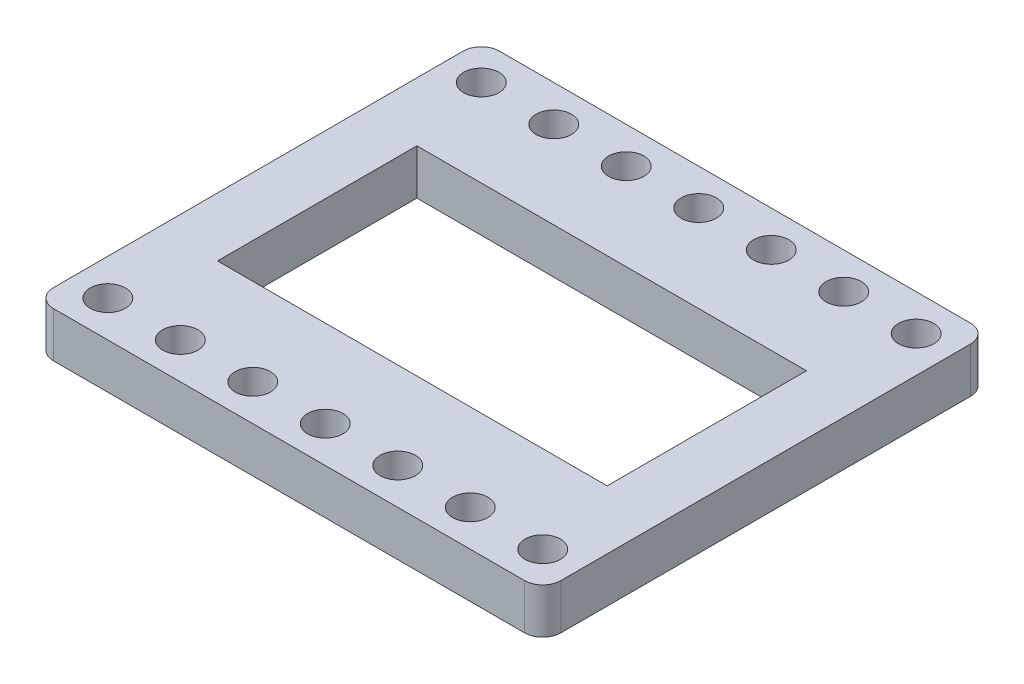
ISO-10303-21;
HEADER;
FILE_DESCRIPTION(('STEP AP214'),'2;1');
FILE_NAME('part.step','',(''),(''),'','','');
FILE_SCHEMA(('AUTOMOTIVE_DESIGN { 1 0 10303 214 1 1 1 1 }'));
ENDSEC;
DATA;
#1=APPLICATION_CONTEXT('core data for automotive mechanical design processes');
#2=APPLICATION_PROTOCOL_DEFINITION('international standard','automotive_design',2000,#1);
#3=PRODUCT_CONTEXT('',#1,'mechanical');
#4=PRODUCT('Part','Part','',(#3));
#5=PRODUCT_RELATED_PRODUCT_CATEGORY('part','',(#4));
#6=PRODUCT_DEFINITION_FORMATION('','',#4);
#7=PRODUCT_DEFINITION_CONTEXT('part definition',#1,'design');
#8=PRODUCT_DEFINITION('design','',#6,#7);
#9=PRODUCT_DEFINITION_SHAPE('','',#8);
#10=(LENGTH_UNIT() NAMED_UNIT(*) SI_UNIT(.MILLI.,.METRE.));
#11=(NAMED_UNIT(*) PLANE_ANGLE_UNIT() SI_UNIT($,.RADIAN.));
#12=(NAMED_UNIT(*) SI_UNIT($,.STERADIAN.) SOLID_ANGLE_UNIT());
#13=UNCERTAINTY_MEASURE_WITH_UNIT(LENGTH_MEASURE(1.E-05),#10,'distance_accuracy_value','');
#14=(GEOMETRIC_REPRESENTATION_CONTEXT(3) GLOBAL_UNCERTAINTY_ASSIGNED_CONTEXT((#13)) GLOBAL_UNIT_ASSIGNED_CONTEXT((#10,
#11,#12)) REPRESENTATION_CONTEXT('',''));
#15=CARTESIAN_POINT('',(0.,0.,0.));
#16=DIRECTION('',(0.,0.,1.));
#17=DIRECTION('',(1.,0.,0.));
#18=AXIS2_PLACEMENT_3D('',#15,#16,#17);
#19=CARTESIAN_POINT('',(-1.99999999999999,5.,47.22));
#20=DIRECTION('',(0.,-1.,0.));
#21=DIRECTION('',(0.,0.,-1.));
#22=AXIS2_PLACEMENT_3D('',#19,#20,#21);
#23=CYLINDRICAL_SURFACE('',#22,2.);
#24=CARTESIAN_POINT('',(-1.99999999999999,0.,47.22));
#25=DIRECTION('',(0.,1.,0.));
#26=DIRECTION('',(0.,0.,1.));
#27=AXIS2_PLACEMENT_3D('',#24,#25,#26);
#28=CIRCLE('',#27,2.);
#29=CARTESIAN_POINT('',(-1.99999999999999,0.,49.22));
#30=VERTEX_POINT('',#29);
#31=CARTESIAN_POINT('',(0.,0.,47.22));
#32=VERTEX_POINT('',#31);
#33=EDGE_CURVE('E236',#30,#32,#28,.T.);
#34=ORIENTED_EDGE('',*,*,#33,.T.);
#35=DIRECTION('',(0.,-1.,0.));
#36=VECTOR('',#35,1.);
#37=CARTESIAN_POINT('',(0.,5.,47.22));
#38=LINE('',#37,#36);
#39=CARTESIAN_POINT('',(0.,5.,47.22));
#40=VERTEX_POINT('',#39);
#41=EDGE_CURVE('E11',#40,#32,#38,.T.);
#42=ORIENTED_EDGE('',*,*,#41,.F.);
#43=CARTESIAN_POINT('',(-1.99999999999999,5.,47.22));
#44=DIRECTION('',(0.,1.,0.));
#45=DIRECTION('',(0.,0.,1.));
#46=AXIS2_PLACEMENT_3D('',#43,#44,#45);
#47=CIRCLE('',#46,2.);
#48=CARTESIAN_POINT('',(-1.99999999999999,5.,49.22));
#49=VERTEX_POINT('',#48);
#50=EDGE_CURVE('E239',#49,#40,#47,.T.);
#51=ORIENTED_EDGE('',*,*,#50,.F.);
#52=DIRECTION('',(0.,-1.,0.));
#53=VECTOR('',#52,1.);
#54=CARTESIAN_POINT('',(-1.99999999999999,5.,49.22));
#55=LINE('',#54,#53);
#56=EDGE_CURVE('E257',#49,#30,#55,.T.);
#57=ORIENTED_EDGE('',*,*,#56,.T.);
#58=EDGE_LOOP('',(#34,#42,#51,#57));
#59=FACE_BOUND('',#58,.T.);
#60=ADVANCED_FACE('F32',(#59),#23,.T.);
#61=CARTESIAN_POINT('',(0.,5.,2.));
#62=DIRECTION('',(-1.,0.,0.));
#63=DIRECTION('',(0.,0.,1.));
#64=AXIS2_PLACEMENT_3D('',#61,#62,#63);
#65=PLANE('',#64);
#66=DIRECTION('',(0.,0.,-1.));
#67=VECTOR('',#66,1.);
#68=CARTESIAN_POINT('',(0.,0.,2.));
#69=LINE('',#68,#67);
#70=CARTESIAN_POINT('',(0.,0.,2.));
#71=VERTEX_POINT('',#70);
#72=EDGE_CURVE('E260',#32,#71,#69,.T.);
#73=ORIENTED_EDGE('',*,*,#72,.T.);
#74=DIRECTION('',(0.,-1.,0.));
#75=VECTOR('',#74,1.);
#76=CARTESIAN_POINT('',(0.,5.,2.));
#77=LINE('',#76,#75);
#78=CARTESIAN_POINT('',(0.,5.,2.));
#79=VERTEX_POINT('',#78);
#80=EDGE_CURVE('E39',#79,#71,#77,.T.);
#81=ORIENTED_EDGE('',*,*,#80,.F.);
#82=DIRECTION('',(0.,0.,-1.));
#83=VECTOR('',#82,1.);
#84=CARTESIAN_POINT('',(0.,5.,2.));
#85=LINE('',#84,#83);
#86=EDGE_CURVE('E242',#40,#79,#85,.T.);
#87=ORIENTED_EDGE('',*,*,#86,.F.);
#88=ORIENTED_EDGE('',*,*,#41,.T.);
#89=EDGE_LOOP('',(#73,#81,#87,#88));
#90=FACE_BOUND('',#89,.T.);
#91=ADVANCED_FACE('F316',(#90),#65,.F.);
#92=CARTESIAN_POINT('',(-2.,5.,2.));
#93=DIRECTION('',(0.,-1.,0.));
#94=DIRECTION('',(0.,0.,-1.));
#95=AXIS2_PLACEMENT_3D('',#92,#93,#94);
#96=CYLINDRICAL_SURFACE('',#95,2.);
#97=CARTESIAN_POINT('',(-2.,0.,2.));
#98=DIRECTION('',(0.,1.,0.));
#99=DIRECTION('',(0.,0.,-1.));
#100=AXIS2_PLACEMENT_3D('',#97,#98,#99);
#101=CIRCLE('',#100,2.);
#102=CARTESIAN_POINT('',(-2.,0.,0.));
#103=VERTEX_POINT('',#102);
#104=EDGE_CURVE('E262',#71,#103,#101,.T.);
#105=ORIENTED_EDGE('',*,*,#104,.T.);
#106=DIRECTION('',(0.,-1.,0.));
#107=VECTOR('',#106,1.);
#108=CARTESIAN_POINT('',(-2.,5.,0.));
#109=LINE('',#108,#107);
#110=CARTESIAN_POINT('',(-2.,5.,0.));
#111=VERTEX_POINT('',#110);
#112=EDGE_CURVE('E287',#111,#103,#109,.T.);
#113=ORIENTED_EDGE('',*,*,#112,.F.);
#114=CARTESIAN_POINT('',(-2.,5.,2.));
#115=DIRECTION('',(0.,1.,0.));
#116=DIRECTION('',(0.,0.,-1.));
#117=AXIS2_PLACEMENT_3D('',#114,#115,#116);
#118=CIRCLE('',#117,2.);
#119=EDGE_CURVE('E245',#79,#111,#118,.T.);
#120=ORIENTED_EDGE('',*,*,#119,.F.);
#121=ORIENTED_EDGE('',*,*,#80,.T.);
#122=EDGE_LOOP('',(#105,#113,#120,#121));
#123=FACE_BOUND('',#122,.T.);
#124=ADVANCED_FACE('F294',(#123),#96,.T.);
#125=CARTESIAN_POINT('',(-54.,5.,0.));
#126=DIRECTION('',(0.,0.,1.));
#127=DIRECTION('',(1.,0.,0.));
#128=AXIS2_PLACEMENT_3D('',#125,#126,#127);
#129=PLANE('',#128);
#130=DIRECTION('',(-1.,0.,0.));
#131=VECTOR('',#130,1.);
#132=CARTESIAN_POINT('',(-54.,0.,0.));
#133=LINE('',#132,#131);
#134=CARTESIAN_POINT('',(-54.,0.,0.));
#135=VERTEX_POINT('',#134);
#136=EDGE_CURVE('E264',#103,#135,#133,.T.);
#137=ORIENTED_EDGE('',*,*,#136,.T.);
#138=DIRECTION('',(0.,-1.,0.));
#139=VECTOR('',#138,1.);
#140=CARTESIAN_POINT('',(-54.,5.,0.));
#141=LINE('',#140,#139);
#142=CARTESIAN_POINT('',(-54.,5.,0.));
#143=VERTEX_POINT('',#142);
#144=EDGE_CURVE('E284',#143,#135,#141,.T.);
#145=ORIENTED_EDGE('',*,*,#144,.F.);
#146=DIRECTION('',(-1.,0.,0.));
#147=VECTOR('',#146,1.);
#148=CARTESIAN_POINT('',(-54.,5.,0.));
#149=LINE('',#148,#147);
#150=EDGE_CURVE('E247',#111,#143,#149,.T.);
#151=ORIENTED_EDGE('',*,*,#150,.F.);
#152=ORIENTED_EDGE('',*,*,#112,.T.);
#153=EDGE_LOOP('',(#137,#145,#151,#152));
#154=FACE_BOUND('',#153,.T.);
#155=ADVANCED_FACE('F304',(#154),#129,.F.);
#156=CARTESIAN_POINT('',(-54.,5.,2.));
#157=DIRECTION('',(0.,-1.,0.));
#158=DIRECTION('',(0.,0.,-1.));
#159=AXIS2_PLACEMENT_3D('',#156,#157,#158);
#160=CYLINDRICAL_SURFACE('',#159,2.);
#161=CARTESIAN_POINT('',(-54.,0.,2.));
#162=DIRECTION('',(0.,1.,0.));
#163=DIRECTION('',(0.,0.,1.));
#164=AXIS2_PLACEMENT_3D('',#161,#162,#163);
#165=CIRCLE('',#164,2.);
#166=CARTESIAN_POINT('',(-56.,0.,2.));
#167=VERTEX_POINT('',#166);
#168=EDGE_CURVE('E266',#135,#167,#165,.T.);
#169=ORIENTED_EDGE('',*,*,#168,.T.);
#170=DIRECTION('',(0.,-1.,0.));
#171=VECTOR('',#170,1.);
#172=CARTESIAN_POINT('',(-56.,5.,2.));
#173=LINE('',#172,#171);
#174=CARTESIAN_POINT('',(-56.,5.,2.));
#175=VERTEX_POINT('',#174);
#176=EDGE_CURVE('E281',#175,#167,#173,.T.);
#177=ORIENTED_EDGE('',*,*,#176,.F.);
#178=CARTESIAN_POINT('',(-54.,5.,2.));
#179=DIRECTION('',(0.,1.,0.));
#180=DIRECTION('',(0.,0.,1.));
#181=AXIS2_PLACEMENT_3D('',#178,#179,#180);
#182=CIRCLE('',#181,2.);
#183=EDGE_CURVE('E249',#143,#175,#182,.T.);
#184=ORIENTED_EDGE('',*,*,#183,.F.);
#185=ORIENTED_EDGE('',*,*,#144,.T.);
#186=EDGE_LOOP('',(#169,#177,#184,#185));
#187=FACE_BOUND('',#186,.T.);
#188=ADVANCED_FACE('F308',(#187),#160,.T.);
#189=CARTESIAN_POINT('',(-56.,5.,2.));
#190=DIRECTION('',(1.,0.,0.));
#191=DIRECTION('',(0.,0.,-1.));
#192=AXIS2_PLACEMENT_3D('',#189,#190,#191);
#193=PLANE('',#192);
#194=DIRECTION('',(0.,0.,1.));
#195=VECTOR('',#194,1.);
#196=CARTESIAN_POINT('',(-56.,0.,2.));
#197=LINE('',#196,#195);
#198=CARTESIAN_POINT('',(-56.,0.,47.22));
#199=VERTEX_POINT('',#198);
#200=EDGE_CURVE('E268',#167,#199,#197,.T.);
#201=ORIENTED_EDGE('',*,*,#200,.T.);
#202=DIRECTION('',(0.,-1.,0.));
#203=VECTOR('',#202,1.);
#204=CARTESIAN_POINT('',(-56.,5.,47.22));
#205=LINE('',#204,#203);
#206=CARTESIAN_POINT('',(-56.,5.,47.22));
#207=VERTEX_POINT('',#206);
#208=EDGE_CURVE('E278',#207,#199,#205,.T.);
#209=ORIENTED_EDGE('',*,*,#208,.F.);
#210=DIRECTION('',(0.,0.,1.));
#211=VECTOR('',#210,1.);
#212=CARTESIAN_POINT('',(-56.,5.,2.));
#213=LINE('',#212,#211);
#214=EDGE_CURVE('E251',#175,#207,#213,.T.);
#215=ORIENTED_EDGE('',*,*,#214,.F.);
#216=ORIENTED_EDGE('',*,*,#176,.T.);
#217=EDGE_LOOP('',(#201,#209,#215,#216));
#218=FACE_BOUND('',#217,.T.);
#219=ADVANCED_FACE('F329',(#218),#193,.F.);
#220=CARTESIAN_POINT('',(-54.,5.,47.22));
#221=DIRECTION('',(0.,-1.,0.));
#222=DIRECTION('',(0.,0.,-1.));
#223=AXIS2_PLACEMENT_3D('',#220,#221,#222);
#224=CYLINDRICAL_SURFACE('',#223,2.);
#225=CARTESIAN_POINT('',(-54.,0.,47.22));
#226=DIRECTION('',(0.,1.,0.));
#227=DIRECTION('',(0.,0.,1.));
#228=AXIS2_PLACEMENT_3D('',#225,#226,#227);
#229=CIRCLE('',#228,2.);
#230=CARTESIAN_POINT('',(-54.,0.,49.22));
#231=VERTEX_POINT('',#230);
#232=EDGE_CURVE('E270',#199,#231,#229,.T.);
#233=ORIENTED_EDGE('',*,*,#232,.T.);
#234=DIRECTION('',(0.,-1.,0.));
#235=VECTOR('',#234,1.);
#236=CARTESIAN_POINT('',(-54.,5.,49.22));
#237=LINE('',#236,#235);
#238=CARTESIAN_POINT('',(-54.,5.,49.22));
#239=VERTEX_POINT('',#238);
#240=EDGE_CURVE('E275',#239,#231,#237,.T.);
#241=ORIENTED_EDGE('',*,*,#240,.F.);
#242=CARTESIAN_POINT('',(-54.,5.,47.22));
#243=DIRECTION('',(0.,1.,0.));
#244=DIRECTION('',(0.,0.,1.));
#245=AXIS2_PLACEMENT_3D('',#242,#243,#244);
#246=CIRCLE('',#245,2.);
#247=EDGE_CURVE('E253',#207,#239,#246,.T.);
#248=ORIENTED_EDGE('',*,*,#247,.F.);
#249=ORIENTED_EDGE('',*,*,#208,.T.);
#250=EDGE_LOOP('',(#233,#241,#248,#249));
#251=FACE_BOUND('',#250,.T.);
#252=ADVANCED_FACE('F327',(#251),#224,.T.);
#253=CARTESIAN_POINT('',(-54.,5.,49.22));
#254=DIRECTION('',(0.,0.,-1.));
#255=DIRECTION('',(-1.,0.,0.));
#256=AXIS2_PLACEMENT_3D('',#253,#254,#255);
#257=PLANE('',#256);
#258=DIRECTION('',(1.,0.,0.));
#259=VECTOR('',#258,1.);
#260=CARTESIAN_POINT('',(-54.,0.,49.22));
#261=LINE('',#260,#259);
#262=EDGE_CURVE('E243',#231,#30,#261,.T.);
#263=ORIENTED_EDGE('',*,*,#262,.T.);
#264=ORIENTED_EDGE('',*,*,#56,.F.);
#265=DIRECTION('',(1.,0.,0.));
#266=VECTOR('',#265,1.);
#267=CARTESIAN_POINT('',(-54.,5.,49.22));
#268=LINE('',#267,#266);
#269=EDGE_CURVE('E255',#239,#49,#268,.T.);
#270=ORIENTED_EDGE('',*,*,#269,.F.);
#271=ORIENTED_EDGE('',*,*,#240,.T.);
#272=EDGE_LOOP('',(#263,#264,#270,#271));
#273=FACE_BOUND('',#272,.T.);
#274=ADVANCED_FACE('F322',(#273),#257,.F.);
#275=CARTESIAN_POINT('',(-1.99999999999999,5.,47.22));
#276=DIRECTION('',(0.,1.,0.));
#277=DIRECTION('',(0.,0.,1.));
#278=AXIS2_PLACEMENT_3D('',#275,#276,#277);
#279=PLANE('',#278);
#280=CARTESIAN_POINT('',(-44.,5.,45.22));
#281=DIRECTION('',(0.,1.,0.));
#282=DIRECTION('',(0.,0.,1.));
#283=AXIS2_PLACEMENT_3D('',#280,#281,#282);
#284=CIRCLE('',#283,1.95);
#285=CARTESIAN_POINT('',(-44.,5.,47.17));
#286=VERTEX_POINT('',#285);
#287=EDGE_CURVE('E162',#286,#286,#284,.T.);
#288=ORIENTED_EDGE('',*,*,#287,.F.);
#289=EDGE_LOOP('',(#288));
#290=FACE_BOUND('',#289,.T.);
#291=CARTESIAN_POINT('',(-52.,5.,45.22));
#292=DIRECTION('',(0.,1.,0.));
#293=DIRECTION('',(0.,0.,1.));
#294=AXIS2_PLACEMENT_3D('',#291,#292,#293);
#295=CIRCLE('',#294,1.95000000000001);
#296=CARTESIAN_POINT('',(-52.,5.,47.17));
#297=VERTEX_POINT('',#296);
#298=EDGE_CURVE('E195',#297,#297,#295,.T.);
#299=ORIENTED_EDGE('',*,*,#298,.F.);
#300=EDGE_LOOP('',(#299));
#301=FACE_BOUND('',#300,.T.);
#302=CARTESIAN_POINT('',(-20.,5.,4.));
#303=DIRECTION('',(0.,1.,0.));
#304=DIRECTION('',(0.,0.,1.));
#305=AXIS2_PLACEMENT_3D('',#302,#303,#304);
#306=CIRCLE('',#305,1.95);
#307=CARTESIAN_POINT('',(-20.,5.,5.95));
#308=VERTEX_POINT('',#307);
#309=EDGE_CURVE('E185',#308,#308,#306,.T.);
#310=ORIENTED_EDGE('',*,*,#309,.F.);
#311=EDGE_LOOP('',(#310));
#312=FACE_BOUND('',#311,.T.);
#313=CARTESIAN_POINT('',(-4.,5.,45.22));
#314=DIRECTION('',(0.,1.,0.));
#315=DIRECTION('',(0.,0.,1.));
#316=AXIS2_PLACEMENT_3D('',#313,#314,#315);
#317=CIRCLE('',#316,1.95);
#318=CARTESIAN_POINT('',(-4.,5.,47.17));
#319=VERTEX_POINT('',#318);
#320=EDGE_CURVE('E176',#319,#319,#317,.T.);
#321=ORIENTED_EDGE('',*,*,#320,.F.);
#322=EDGE_LOOP('',(#321));
#323=FACE_BOUND('',#322,.T.);
#324=CARTESIAN_POINT('',(-12.,5.,45.22));
#325=DIRECTION('',(0.,1.,0.));
#326=DIRECTION('',(0.,0.,1.));
#327=AXIS2_PLACEMENT_3D('',#324,#325,#326);
#328=CIRCLE('',#327,1.95);
#329=CARTESIAN_POINT('',(-12.,5.,47.17));
#330=VERTEX_POINT('',#329);
#331=EDGE_CURVE('E177',#330,#330,#328,.T.);
#332=ORIENTED_EDGE('',*,*,#331,.F.);
#333=EDGE_LOOP('',(#332));
#334=FACE_BOUND('',#333,.T.);
#335=CARTESIAN_POINT('',(-12.,5.,4.));
#336=DIRECTION('',(0.,1.,0.));
#337=DIRECTION('',(0.,0.,1.));
#338=AXIS2_PLACEMENT_3D('',#335,#336,#337);
#339=CIRCLE('',#338,1.95);
#340=CARTESIAN_POINT('',(-12.,5.,5.95));
#341=VERTEX_POINT('',#340);
#342=EDGE_CURVE('E206',#341,#341,#339,.T.);
#343=ORIENTED_EDGE('',*,*,#342,.F.);
#344=EDGE_LOOP('',(#343));
#345=FACE_BOUND('',#344,.T.);
#346=CARTESIAN_POINT('',(-52.,5.,4.00000000000001));
#347=DIRECTION('',(0.,1.,0.));
#348=DIRECTION('',(0.,0.,1.));
#349=AXIS2_PLACEMENT_3D('',#346,#347,#348);
#350=CIRCLE('',#349,1.95000000000001);
#351=CARTESIAN_POINT('',(-52.,5.,5.95000000000001));
#352=VERTEX_POINT('',#351);
#353=EDGE_CURVE('E207',#352,#352,#350,.T.);
#354=ORIENTED_EDGE('',*,*,#353,.F.);
#355=EDGE_LOOP('',(#354));
#356=FACE_BOUND('',#355,.T.);
#357=CARTESIAN_POINT('',(-44.,5.,4.00000000000001));
#358=DIRECTION('',(0.,1.,0.));
#359=DIRECTION('',(0.,0.,1.));
#360=AXIS2_PLACEMENT_3D('',#357,#358,#359);
#361=CIRCLE('',#360,1.95);
#362=CARTESIAN_POINT('',(-44.,5.,5.95));
#363=VERTEX_POINT('',#362);
#364=EDGE_CURVE('E213',#363,#363,#361,.T.);
#365=ORIENTED_EDGE('',*,*,#364,.F.);
#366=EDGE_LOOP('',(#365));
#367=FACE_BOUND('',#366,.T.);
#368=CARTESIAN_POINT('',(-36.,5.,4.));
#369=DIRECTION('',(0.,1.,0.));
#370=DIRECTION('',(0.,0.,1.));
#371=AXIS2_PLACEMENT_3D('',#368,#369,#370);
#372=CIRCLE('',#371,1.95);
#373=CARTESIAN_POINT('',(-36.,5.,5.95));
#374=VERTEX_POINT('',#373);
#375=EDGE_CURVE('E219',#374,#374,#372,.T.);
#376=ORIENTED_EDGE('',*,*,#375,.F.);
#377=EDGE_LOOP('',(#376));
#378=FACE_BOUND('',#377,.T.);
#379=CARTESIAN_POINT('',(-28.,5.,4.));
#380=DIRECTION('',(0.,1.,0.));
#381=DIRECTION('',(0.,0.,1.));
#382=AXIS2_PLACEMENT_3D('',#379,#380,#381);
#383=CIRCLE('',#382,1.95);
#384=CARTESIAN_POINT('',(-28.,5.,5.95));
#385=VERTEX_POINT('',#384);
#386=EDGE_CURVE('E184',#385,#385,#383,.T.);
#387=ORIENTED_EDGE('',*,*,#386,.F.);
#388=EDGE_LOOP('',(#387));
#389=FACE_BOUND('',#388,.T.);
#390=DIRECTION('',(0.,0.,1.));
#391=VECTOR('',#390,1.);
#392=CARTESIAN_POINT('',(-49.5,5.,13.61));
#393=LINE('',#392,#391);
#394=CARTESIAN_POINT('',(-49.5,5.,13.61));
#395=VERTEX_POINT('',#394);
#396=CARTESIAN_POINT('',(-49.5,5.,35.61));
#397=VERTEX_POINT('',#396);
#398=EDGE_CURVE('E46',#395,#397,#393,.T.);
#399=ORIENTED_EDGE('',*,*,#398,.F.);
#400=DIRECTION('',(-1.,0.,0.));
#401=VECTOR('',#400,1.);
#402=CARTESIAN_POINT('',(-49.5,5.,13.61));
#403=LINE('',#402,#401);
#404=CARTESIAN_POINT('',(-6.49999999999999,5.,13.61));
#405=VERTEX_POINT('',#404);
#406=EDGE_CURVE('E138',#405,#395,#403,.T.);
#407=ORIENTED_EDGE('',*,*,#406,.F.);
#408=DIRECTION('',(0.,0.,-1.));
#409=VECTOR('',#408,1.);
#410=CARTESIAN_POINT('',(-6.49999999999999,5.,13.61));
#411=LINE('',#410,#409);
#412=CARTESIAN_POINT('',(-6.49999999999999,5.,35.61));
#413=VERTEX_POINT('',#412);
#414=EDGE_CURVE('E141',#413,#405,#411,.T.);
#415=ORIENTED_EDGE('',*,*,#414,.F.);
#416=DIRECTION('',(1.,0.,0.));
#417=VECTOR('',#416,1.);
#418=CARTESIAN_POINT('',(-49.5,5.,35.61));
#419=LINE('',#418,#417);
#420=EDGE_CURVE('E150',#397,#413,#419,.T.);
#421=ORIENTED_EDGE('',*,*,#420,.F.);
#422=EDGE_LOOP('',(#399,#407,#415,#421));
#423=FACE_BOUND('',#422,.T.);
#424=CARTESIAN_POINT('',(-20.,5.,45.22));
#425=DIRECTION('',(0.,1.,0.));
#426=DIRECTION('',(0.,0.,1.));
#427=AXIS2_PLACEMENT_3D('',#424,#425,#426);
#428=CIRCLE('',#427,1.95);
#429=CARTESIAN_POINT('',(-20.,5.,47.17));
#430=VERTEX_POINT('',#429);
#431=EDGE_CURVE('E144',#430,#430,#428,.T.);
#432=ORIENTED_EDGE('',*,*,#431,.F.);
#433=EDGE_LOOP('',(#432));
#434=FACE_BOUND('',#433,.T.);
#435=CARTESIAN_POINT('',(-28.,5.,45.22));
#436=DIRECTION('',(0.,1.,0.));
#437=DIRECTION('',(0.,0.,1.));
#438=AXIS2_PLACEMENT_3D('',#435,#436,#437);
#439=CIRCLE('',#438,1.95);
#440=CARTESIAN_POINT('',(-28.,5.,47.17));
#441=VERTEX_POINT('',#440);
#442=EDGE_CURVE('E169',#441,#441,#439,.T.);
#443=ORIENTED_EDGE('',*,*,#442,.F.);
#444=EDGE_LOOP('',(#443));
#445=FACE_BOUND('',#444,.T.);
#446=CARTESIAN_POINT('',(-36.,5.,45.22));
#447=DIRECTION('',(0.,1.,0.));
#448=DIRECTION('',(0.,0.,1.));
#449=AXIS2_PLACEMENT_3D('',#446,#447,#448);
#450=CIRCLE('',#449,1.95);
#451=CARTESIAN_POINT('',(-36.,5.,47.17));
#452=VERTEX_POINT('',#451);
#453=EDGE_CURVE('E163',#452,#452,#450,.T.);
#454=ORIENTED_EDGE('',*,*,#453,.F.);
#455=EDGE_LOOP('',(#454));
#456=FACE_BOUND('',#455,.T.);
#457=CARTESIAN_POINT('',(-4.,5.,4.));
#458=DIRECTION('',(0.,1.,0.));
#459=DIRECTION('',(0.,0.,1.));
#460=AXIS2_PLACEMENT_3D('',#457,#458,#459);
#461=CIRCLE('',#460,1.95);
#462=CARTESIAN_POINT('',(-4.,5.,5.94999999999999));
#463=VERTEX_POINT('',#462);
#464=EDGE_CURVE('E230',#463,#463,#461,.T.);
#465=ORIENTED_EDGE('',*,*,#464,.F.);
#466=EDGE_LOOP('',(#465));
#467=FACE_BOUND('',#466,.T.);
#468=ORIENTED_EDGE('',*,*,#50,.T.);
#469=ORIENTED_EDGE('',*,*,#86,.T.);
#470=ORIENTED_EDGE('',*,*,#119,.T.);
#471=ORIENTED_EDGE('',*,*,#150,.T.);
#472=ORIENTED_EDGE('',*,*,#183,.T.);
#473=ORIENTED_EDGE('',*,*,#214,.T.);
#474=ORIENTED_EDGE('',*,*,#247,.T.);
#475=ORIENTED_EDGE('',*,*,#269,.T.);
#476=EDGE_LOOP('',(#468,#469,#470,#471,#472,#473,#474,#475));
#477=FACE_BOUND('',#476,.T.);
#478=ADVANCED_FACE('F312',(#290,#301,#312,#323,#334,#345,#356,#367,#378,#389,#423,#434,#445,
#456,#467,#477),#279,.T.);
#479=CARTESIAN_POINT('',(-1.99999999999999,0.,47.22));
#480=DIRECTION('',(0.,1.,0.));
#481=DIRECTION('',(0.,0.,1.));
#482=AXIS2_PLACEMENT_3D('',#479,#480,#481);
#483=PLANE('',#482);
#484=CARTESIAN_POINT('',(-44.,0.,45.22));
#485=DIRECTION('',(0.,1.,0.));
#486=DIRECTION('',(0.,0.,1.));
#487=AXIS2_PLACEMENT_3D('',#484,#485,#486);
#488=CIRCLE('',#487,1.95);
#489=CARTESIAN_POINT('',(-44.,0.,47.17));
#490=VERTEX_POINT('',#489);
#491=EDGE_CURVE('E198',#490,#490,#488,.T.);
#492=ORIENTED_EDGE('',*,*,#491,.T.);
#493=EDGE_LOOP('',(#492));
#494=FACE_BOUND('',#493,.T.);
#495=CARTESIAN_POINT('',(-52.,0.,45.22));
#496=DIRECTION('',(0.,1.,0.));
#497=DIRECTION('',(0.,0.,1.));
#498=AXIS2_PLACEMENT_3D('',#495,#496,#497);
#499=CIRCLE('',#498,1.95000000000001);
#500=CARTESIAN_POINT('',(-52.,0.,47.17));
#501=VERTEX_POINT('',#500);
#502=EDGE_CURVE('E180',#501,#501,#499,.T.);
#503=ORIENTED_EDGE('',*,*,#502,.T.);
#504=EDGE_LOOP('',(#503));
#505=FACE_BOUND('',#504,.T.);
#506=CARTESIAN_POINT('',(-20.,0.,4.));
#507=DIRECTION('',(0.,1.,0.));
#508=DIRECTION('',(0.,0.,1.));
#509=AXIS2_PLACEMENT_3D('',#506,#507,#508);
#510=CIRCLE('',#509,1.95);
#511=CARTESIAN_POINT('',(-20.,0.,5.95));
#512=VERTEX_POINT('',#511);
#513=EDGE_CURVE('E181',#512,#512,#510,.T.);
#514=ORIENTED_EDGE('',*,*,#513,.T.);
#515=EDGE_LOOP('',(#514));
#516=FACE_BOUND('',#515,.T.);
#517=CARTESIAN_POINT('',(-4.,0.,45.22));
#518=DIRECTION('',(0.,1.,0.));
#519=DIRECTION('',(0.,0.,1.));
#520=AXIS2_PLACEMENT_3D('',#517,#518,#519);
#521=CIRCLE('',#520,1.95);
#522=CARTESIAN_POINT('',(-4.,0.,47.17));
#523=VERTEX_POINT('',#522);
#524=EDGE_CURVE('E188',#523,#523,#521,.T.);
#525=ORIENTED_EDGE('',*,*,#524,.T.);
#526=EDGE_LOOP('',(#525));
#527=FACE_BOUND('',#526,.T.);
#528=CARTESIAN_POINT('',(-12.,0.,45.22));
#529=DIRECTION('',(0.,1.,0.));
#530=DIRECTION('',(0.,0.,1.));
#531=AXIS2_PLACEMENT_3D('',#528,#529,#530);
#532=CIRCLE('',#531,1.95);
#533=CARTESIAN_POINT('',(-12.,0.,47.17));
#534=VERTEX_POINT('',#533);
#535=EDGE_CURVE('E173',#534,#534,#532,.T.);
#536=ORIENTED_EDGE('',*,*,#535,.T.);
#537=EDGE_LOOP('',(#536));
#538=FACE_BOUND('',#537,.T.);
#539=CARTESIAN_POINT('',(-12.,0.,4.));
#540=DIRECTION('',(0.,1.,0.));
#541=DIRECTION('',(0.,0.,1.));
#542=AXIS2_PLACEMENT_3D('',#539,#540,#541);
#543=CIRCLE('',#542,1.95);
#544=CARTESIAN_POINT('',(-12.,0.,5.95));
#545=VERTEX_POINT('',#544);
#546=EDGE_CURVE('E227',#545,#545,#543,.T.);
#547=ORIENTED_EDGE('',*,*,#546,.T.);
#548=EDGE_LOOP('',(#547));
#549=FACE_BOUND('',#548,.T.);
#550=CARTESIAN_POINT('',(-52.,0.,4.00000000000001));
#551=DIRECTION('',(0.,1.,0.));
#552=DIRECTION('',(0.,0.,1.));
#553=AXIS2_PLACEMENT_3D('',#550,#551,#552);
#554=CIRCLE('',#553,1.95000000000001);
#555=CARTESIAN_POINT('',(-52.,0.,5.95000000000001));
#556=VERTEX_POINT('',#555);
#557=EDGE_CURVE('E203',#556,#556,#554,.T.);
#558=ORIENTED_EDGE('',*,*,#557,.T.);
#559=EDGE_LOOP('',(#558));
#560=FACE_BOUND('',#559,.T.);
#561=CARTESIAN_POINT('',(-44.,0.,4.00000000000001));
#562=DIRECTION('',(0.,1.,0.));
#563=DIRECTION('',(0.,0.,1.));
#564=AXIS2_PLACEMENT_3D('',#561,#562,#563);
#565=CIRCLE('',#564,1.95);
#566=CARTESIAN_POINT('',(-44.,0.,5.95));
#567=VERTEX_POINT('',#566);
#568=EDGE_CURVE('E210',#567,#567,#565,.T.);
#569=ORIENTED_EDGE('',*,*,#568,.T.);
#570=EDGE_LOOP('',(#569));
#571=FACE_BOUND('',#570,.T.);
#572=CARTESIAN_POINT('',(-36.,0.,4.));
#573=DIRECTION('',(0.,1.,0.));
#574=DIRECTION('',(0.,0.,1.));
#575=AXIS2_PLACEMENT_3D('',#572,#573,#574);
#576=CIRCLE('',#575,1.95);
#577=CARTESIAN_POINT('',(-36.,0.,5.95));
#578=VERTEX_POINT('',#577);
#579=EDGE_CURVE('E216',#578,#578,#576,.T.);
#580=ORIENTED_EDGE('',*,*,#579,.T.);
#581=EDGE_LOOP('',(#580));
#582=FACE_BOUND('',#581,.T.);
#583=CARTESIAN_POINT('',(-28.,0.,4.));
#584=DIRECTION('',(0.,1.,0.));
#585=DIRECTION('',(0.,0.,1.));
#586=AXIS2_PLACEMENT_3D('',#583,#584,#585);
#587=CIRCLE('',#586,1.95);
#588=CARTESIAN_POINT('',(-28.,0.,5.95));
#589=VERTEX_POINT('',#588);
#590=EDGE_CURVE('E222',#589,#589,#587,.T.);
#591=ORIENTED_EDGE('',*,*,#590,.T.);
#592=EDGE_LOOP('',(#591));
#593=FACE_BOUND('',#592,.T.);
#594=DIRECTION('',(-1.,0.,0.));
#595=VECTOR('',#594,1.);
#596=CARTESIAN_POINT('',(-49.5,0.,13.61));
#597=LINE('',#596,#595);
#598=CARTESIAN_POINT('',(-6.49999999999999,0.,13.61));
#599=VERTEX_POINT('',#598);
#600=CARTESIAN_POINT('',(-49.5,0.,13.61));
#601=VERTEX_POINT('',#600);
#602=EDGE_CURVE('E128',#599,#601,#597,.T.);
#603=ORIENTED_EDGE('',*,*,#602,.T.);
#604=DIRECTION('',(0.,0.,1.));
#605=VECTOR('',#604,1.);
#606=CARTESIAN_POINT('',(-49.5,0.,13.61));
#607=LINE('',#606,#605);
#608=CARTESIAN_POINT('',(-49.5,0.,35.61));
#609=VERTEX_POINT('',#608);
#610=EDGE_CURVE('E122',#601,#609,#607,.T.);
#611=ORIENTED_EDGE('',*,*,#610,.T.);
#612=DIRECTION('',(1.,0.,0.));
#613=VECTOR('',#612,1.);
#614=CARTESIAN_POINT('',(-49.5,0.,35.61));
#615=LINE('',#614,#613);
#616=CARTESIAN_POINT('',(-6.49999999999999,0.,35.61));
#617=VERTEX_POINT('',#616);
#618=EDGE_CURVE('E131',#609,#617,#615,.T.);
#619=ORIENTED_EDGE('',*,*,#618,.T.);
#620=DIRECTION('',(0.,0.,-1.));
#621=VECTOR('',#620,1.);
#622=CARTESIAN_POINT('',(-6.49999999999999,0.,13.61));
#623=LINE('',#622,#621);
#624=EDGE_CURVE('E54',#617,#599,#623,.T.);
#625=ORIENTED_EDGE('',*,*,#624,.T.);
#626=EDGE_LOOP('',(#603,#611,#619,#625));
#627=FACE_BOUND('',#626,.T.);
#628=CARTESIAN_POINT('',(-20.,0.,45.22));
#629=DIRECTION('',(0.,1.,0.));
#630=DIRECTION('',(0.,0.,1.));
#631=AXIS2_PLACEMENT_3D('',#628,#629,#630);
#632=CIRCLE('',#631,1.95);
#633=CARTESIAN_POINT('',(-20.,0.,47.17));
#634=VERTEX_POINT('',#633);
#635=EDGE_CURVE('E172',#634,#634,#632,.T.);
#636=ORIENTED_EDGE('',*,*,#635,.T.);
#637=EDGE_LOOP('',(#636));
#638=FACE_BOUND('',#637,.T.);
#639=CARTESIAN_POINT('',(-28.,0.,45.22));
#640=DIRECTION('',(0.,1.,0.));
#641=DIRECTION('',(0.,0.,1.));
#642=AXIS2_PLACEMENT_3D('',#639,#640,#641);
#643=CIRCLE('',#642,1.95);
#644=CARTESIAN_POINT('',(-28.,0.,47.17));
#645=VERTEX_POINT('',#644);
#646=EDGE_CURVE('E166',#645,#645,#643,.T.);
#647=ORIENTED_EDGE('',*,*,#646,.T.);
#648=EDGE_LOOP('',(#647));
#649=FACE_BOUND('',#648,.T.);
#650=CARTESIAN_POINT('',(-36.,0.,45.22));
#651=DIRECTION('',(0.,1.,0.));
#652=DIRECTION('',(0.,0.,1.));
#653=AXIS2_PLACEMENT_3D('',#650,#651,#652);
#654=CIRCLE('',#653,1.95);
#655=CARTESIAN_POINT('',(-36.,0.,47.17));
#656=VERTEX_POINT('',#655);
#657=EDGE_CURVE('E159',#656,#656,#654,.T.);
#658=ORIENTED_EDGE('',*,*,#657,.T.);
#659=EDGE_LOOP('',(#658));
#660=FACE_BOUND('',#659,.T.);
#661=CARTESIAN_POINT('',(-4.,0.,4.));
#662=DIRECTION('',(0.,1.,0.));
#663=DIRECTION('',(0.,0.,1.));
#664=AXIS2_PLACEMENT_3D('',#661,#662,#663);
#665=CIRCLE('',#664,1.95);
#666=CARTESIAN_POINT('',(-4.,0.,5.94999999999999));
#667=VERTEX_POINT('',#666);
#668=EDGE_CURVE('E233',#667,#667,#665,.T.);
#669=ORIENTED_EDGE('',*,*,#668,.T.);
#670=EDGE_LOOP('',(#669));
#671=FACE_BOUND('',#670,.T.);
#672=ORIENTED_EDGE('',*,*,#33,.F.);
#673=ORIENTED_EDGE('',*,*,#262,.F.);
#674=ORIENTED_EDGE('',*,*,#232,.F.);
#675=ORIENTED_EDGE('',*,*,#200,.F.);
#676=ORIENTED_EDGE('',*,*,#168,.F.);
#677=ORIENTED_EDGE('',*,*,#136,.F.);
#678=ORIENTED_EDGE('',*,*,#104,.F.);
#679=ORIENTED_EDGE('',*,*,#72,.F.);
#680=EDGE_LOOP('',(#672,#673,#674,#675,#676,#677,#678,#679));
#681=FACE_BOUND('',#680,.T.);
#682=ADVANCED_FACE('F135',(#494,#505,#516,#527,#538,#549,#560,#571,#582,#593,#627,#638,#649,
#660,#671,#681),#483,.F.);
#683=CARTESIAN_POINT('',(-4.,0.,4.));
#684=DIRECTION('',(0.,1.,0.));
#685=DIRECTION('',(0.,0.,1.));
#686=AXIS2_PLACEMENT_3D('',#683,#684,#685);
#687=CYLINDRICAL_SURFACE('',#686,1.95);
#688=ORIENTED_EDGE('',*,*,#668,.F.);
#689=EDGE_LOOP('',(#688));
#690=FACE_BOUND('',#689,.T.);
#691=ORIENTED_EDGE('',*,*,#464,.T.);
#692=EDGE_LOOP('',(#691));
#693=FACE_BOUND('',#692,.T.);
#694=ADVANCED_FACE('F392',(#690,#693),#687,.F.);
#695=CARTESIAN_POINT('',(-36.,0.,45.22));
#696=DIRECTION('',(0.,1.,0.));
#697=DIRECTION('',(0.,0.,1.));
#698=AXIS2_PLACEMENT_3D('',#695,#696,#697);
#699=CYLINDRICAL_SURFACE('',#698,1.95);
#700=ORIENTED_EDGE('',*,*,#657,.F.);
#701=EDGE_LOOP('',(#700));
#702=FACE_BOUND('',#701,.T.);
#703=ORIENTED_EDGE('',*,*,#453,.T.);
#704=EDGE_LOOP('',(#703));
#705=FACE_BOUND('',#704,.T.);
#706=ADVANCED_FACE('F402',(#702,#705),#699,.F.);
#707=CARTESIAN_POINT('',(-28.,0.,45.22));
#708=DIRECTION('',(0.,1.,0.));
#709=DIRECTION('',(0.,0.,1.));
#710=AXIS2_PLACEMENT_3D('',#707,#708,#709);
#711=CYLINDRICAL_SURFACE('',#710,1.95);
#712=ORIENTED_EDGE('',*,*,#646,.F.);
#713=EDGE_LOOP('',(#712));
#714=FACE_BOUND('',#713,.T.);
#715=ORIENTED_EDGE('',*,*,#442,.T.);
#716=EDGE_LOOP('',(#715));
#717=FACE_BOUND('',#716,.T.);
#718=ADVANCED_FACE('F412',(#714,#717),#711,.F.);
#719=CARTESIAN_POINT('',(-20.,0.,45.22));
#720=DIRECTION('',(0.,1.,0.));
#721=DIRECTION('',(0.,0.,1.));
#722=AXIS2_PLACEMENT_3D('',#719,#720,#721);
#723=CYLINDRICAL_SURFACE('',#722,1.95);
#724=ORIENTED_EDGE('',*,*,#635,.F.);
#725=EDGE_LOOP('',(#724));
#726=FACE_BOUND('',#725,.T.);
#727=ORIENTED_EDGE('',*,*,#431,.T.);
#728=EDGE_LOOP('',(#727));
#729=FACE_BOUND('',#728,.T.);
#730=ADVANCED_FACE('F422',(#726,#729),#723,.F.);
#731=CARTESIAN_POINT('',(-49.5,0.,13.61));
#732=DIRECTION('',(-1.,0.,0.));
#733=DIRECTION('',(0.,0.,1.));
#734=AXIS2_PLACEMENT_3D('',#731,#732,#733);
#735=PLANE('',#734);
#736=ORIENTED_EDGE('',*,*,#398,.T.);
#737=DIRECTION('',(0.,1.,0.));
#738=VECTOR('',#737,1.);
#739=CARTESIAN_POINT('',(-49.5,0.,35.61));
#740=LINE('',#739,#738);
#741=EDGE_CURVE('E118',#609,#397,#740,.T.);
#742=ORIENTED_EDGE('',*,*,#741,.F.);
#743=ORIENTED_EDGE('',*,*,#610,.F.);
#744=DIRECTION('',(0.,1.,0.));
#745=VECTOR('',#744,1.);
#746=CARTESIAN_POINT('',(-49.5,0.,13.61));
#747=LINE('',#746,#745);
#748=EDGE_CURVE('E154',#601,#395,#747,.T.);
#749=ORIENTED_EDGE('',*,*,#748,.T.);
#750=EDGE_LOOP('',(#736,#742,#743,#749));
#751=FACE_BOUND('',#750,.T.);
#752=ADVANCED_FACE('F120',(#751),#735,.F.);
#753=CARTESIAN_POINT('',(-49.5,0.,13.61));
#754=DIRECTION('',(0.,0.,-1.));
#755=DIRECTION('',(-1.,0.,0.));
#756=AXIS2_PLACEMENT_3D('',#753,#754,#755);
#757=PLANE('',#756);
#758=ORIENTED_EDGE('',*,*,#406,.T.);
#759=ORIENTED_EDGE('',*,*,#748,.F.);
#760=ORIENTED_EDGE('',*,*,#602,.F.);
#761=DIRECTION('',(0.,1.,0.));
#762=VECTOR('',#761,1.);
#763=CARTESIAN_POINT('',(-6.49999999999999,0.,13.61));
#764=LINE('',#763,#762);
#765=EDGE_CURVE('E156',#599,#405,#764,.T.);
#766=ORIENTED_EDGE('',*,*,#765,.T.);
#767=EDGE_LOOP('',(#758,#759,#760,#766));
#768=FACE_BOUND('',#767,.T.);
#769=ADVANCED_FACE('F441',(#768),#757,.F.);
#770=CARTESIAN_POINT('',(-6.49999999999999,0.,13.61));
#771=DIRECTION('',(1.,0.,0.));
#772=DIRECTION('',(0.,0.,-1.));
#773=AXIS2_PLACEMENT_3D('',#770,#771,#772);
#774=PLANE('',#773);
#775=ORIENTED_EDGE('',*,*,#414,.T.);
#776=ORIENTED_EDGE('',*,*,#765,.F.);
#777=ORIENTED_EDGE('',*,*,#624,.F.);
#778=DIRECTION('',(0.,1.,0.));
#779=VECTOR('',#778,1.);
#780=CARTESIAN_POINT('',(-6.49999999999999,0.,35.61));
#781=LINE('',#780,#779);
#782=EDGE_CURVE('E127',#617,#413,#781,.T.);
#783=ORIENTED_EDGE('',*,*,#782,.T.);
#784=EDGE_LOOP('',(#775,#776,#777,#783));
#785=FACE_BOUND('',#784,.T.);
#786=ADVANCED_FACE('F450',(#785),#774,.F.);
#787=CARTESIAN_POINT('',(-49.5,0.,35.61));
#788=DIRECTION('',(0.,0.,1.));
#789=DIRECTION('',(1.,0.,0.));
#790=AXIS2_PLACEMENT_3D('',#787,#788,#789);
#791=PLANE('',#790);
#792=ORIENTED_EDGE('',*,*,#420,.T.);
#793=ORIENTED_EDGE('',*,*,#782,.F.);
#794=ORIENTED_EDGE('',*,*,#618,.F.);
#795=ORIENTED_EDGE('',*,*,#741,.T.);
#796=EDGE_LOOP('',(#792,#793,#794,#795));
#797=FACE_BOUND('',#796,.T.);
#798=ADVANCED_FACE('F132',(#797),#791,.F.);
#799=CARTESIAN_POINT('',(-28.,0.,4.));
#800=DIRECTION('',(0.,1.,0.));
#801=DIRECTION('',(0.,0.,1.));
#802=AXIS2_PLACEMENT_3D('',#799,#800,#801);
#803=CYLINDRICAL_SURFACE('',#802,1.95);
#804=ORIENTED_EDGE('',*,*,#590,.F.);
#805=EDGE_LOOP('',(#804));
#806=FACE_BOUND('',#805,.T.);
#807=ORIENTED_EDGE('',*,*,#386,.T.);
#808=EDGE_LOOP('',(#807));
#809=FACE_BOUND('',#808,.T.);
#810=ADVANCED_FACE('F468',(#806,#809),#803,.F.);
#811=CARTESIAN_POINT('',(-36.,0.,4.));
#812=DIRECTION('',(0.,1.,0.));
#813=DIRECTION('',(0.,0.,1.));
#814=AXIS2_PLACEMENT_3D('',#811,#812,#813);
#815=CYLINDRICAL_SURFACE('',#814,1.95);
#816=ORIENTED_EDGE('',*,*,#579,.F.);
#817=EDGE_LOOP('',(#816));
#818=FACE_BOUND('',#817,.T.);
#819=ORIENTED_EDGE('',*,*,#375,.T.);
#820=EDGE_LOOP('',(#819));
#821=FACE_BOUND('',#820,.T.);
#822=ADVANCED_FACE('F477',(#818,#821),#815,.F.);
#823=CARTESIAN_POINT('',(-44.,0.,4.00000000000001));
#824=DIRECTION('',(0.,1.,0.));
#825=DIRECTION('',(0.,0.,1.));
#826=AXIS2_PLACEMENT_3D('',#823,#824,#825);
#827=CYLINDRICAL_SURFACE('',#826,1.95);
#828=ORIENTED_EDGE('',*,*,#568,.F.);
#829=EDGE_LOOP('',(#828));
#830=FACE_BOUND('',#829,.T.);
#831=ORIENTED_EDGE('',*,*,#364,.T.);
#832=EDGE_LOOP('',(#831));
#833=FACE_BOUND('',#832,.T.);
#834=ADVANCED_FACE('F487',(#830,#833),#827,.F.);
#835=CARTESIAN_POINT('',(-52.,0.,4.00000000000001));
#836=DIRECTION('',(0.,1.,0.));
#837=DIRECTION('',(0.,0.,1.));
#838=AXIS2_PLACEMENT_3D('',#835,#836,#837);
#839=CYLINDRICAL_SURFACE('',#838,1.95000000000001);
#840=ORIENTED_EDGE('',*,*,#557,.F.);
#841=EDGE_LOOP('',(#840));
#842=FACE_BOUND('',#841,.T.);
#843=ORIENTED_EDGE('',*,*,#353,.T.);
#844=EDGE_LOOP('',(#843));
#845=FACE_BOUND('',#844,.T.);
#846=ADVANCED_FACE('F497',(#842,#845),#839,.F.);
#847=CARTESIAN_POINT('',(-12.,0.,4.));
#848=DIRECTION('',(0.,1.,0.));
#849=DIRECTION('',(0.,0.,1.));
#850=AXIS2_PLACEMENT_3D('',#847,#848,#849);
#851=CYLINDRICAL_SURFACE('',#850,1.95);
#852=ORIENTED_EDGE('',*,*,#546,.F.);
#853=EDGE_LOOP('',(#852));
#854=FACE_BOUND('',#853,.T.);
#855=ORIENTED_EDGE('',*,*,#342,.T.);
#856=EDGE_LOOP('',(#855));
#857=FACE_BOUND('',#856,.T.);
#858=ADVANCED_FACE('F507',(#854,#857),#851,.F.);
#859=CARTESIAN_POINT('',(-12.,0.,45.22));
#860=DIRECTION('',(0.,1.,0.));
#861=DIRECTION('',(0.,0.,1.));
#862=AXIS2_PLACEMENT_3D('',#859,#860,#861);
#863=CYLINDRICAL_SURFACE('',#862,1.95);
#864=ORIENTED_EDGE('',*,*,#535,.F.);
#865=EDGE_LOOP('',(#864));
#866=FACE_BOUND('',#865,.T.);
#867=ORIENTED_EDGE('',*,*,#331,.T.);
#868=EDGE_LOOP('',(#867));
#869=FACE_BOUND('',#868,.T.);
#870=ADVANCED_FACE('F517',(#866,#869),#863,.F.);
#871=CARTESIAN_POINT('',(-4.,0.,45.22));
#872=DIRECTION('',(0.,1.,0.));
#873=DIRECTION('',(0.,0.,1.));
#874=AXIS2_PLACEMENT_3D('',#871,#872,#873);
#875=CYLINDRICAL_SURFACE('',#874,1.95);
#876=ORIENTED_EDGE('',*,*,#524,.F.);
#877=EDGE_LOOP('',(#876));
#878=FACE_BOUND('',#877,.T.);
#879=ORIENTED_EDGE('',*,*,#320,.T.);
#880=EDGE_LOOP('',(#879));
#881=FACE_BOUND('',#880,.T.);
#882=ADVANCED_FACE('F527',(#878,#881),#875,.F.);
#883=CARTESIAN_POINT('',(-20.,0.,4.));
#884=DIRECTION('',(0.,1.,0.));
#885=DIRECTION('',(0.,0.,1.));
#886=AXIS2_PLACEMENT_3D('',#883,#884,#885);
#887=CYLINDRICAL_SURFACE('',#886,1.95);
#888=ORIENTED_EDGE('',*,*,#513,.F.);
#889=EDGE_LOOP('',(#888));
#890=FACE_BOUND('',#889,.T.);
#891=ORIENTED_EDGE('',*,*,#309,.T.);
#892=EDGE_LOOP('',(#891));
#893=FACE_BOUND('',#892,.T.);
#894=ADVANCED_FACE('F537',(#890,#893),#887,.F.);
#895=CARTESIAN_POINT('',(-52.,0.,45.22));
#896=DIRECTION('',(0.,1.,0.));
#897=DIRECTION('',(0.,0.,1.));
#898=AXIS2_PLACEMENT_3D('',#895,#896,#897);
#899=CYLINDRICAL_SURFACE('',#898,1.95000000000001);
#900=ORIENTED_EDGE('',*,*,#502,.F.);
#901=EDGE_LOOP('',(#900));
#902=FACE_BOUND('',#901,.T.);
#903=ORIENTED_EDGE('',*,*,#298,.T.);
#904=EDGE_LOOP('',(#903));
#905=FACE_BOUND('',#904,.T.);
#906=ADVANCED_FACE('F547',(#902,#905),#899,.F.);
#907=CARTESIAN_POINT('',(-44.,0.,45.22));
#908=DIRECTION('',(0.,1.,0.));
#909=DIRECTION('',(0.,0.,1.));
#910=AXIS2_PLACEMENT_3D('',#907,#908,#909);
#911=CYLINDRICAL_SURFACE('',#910,1.95);
#912=ORIENTED_EDGE('',*,*,#491,.F.);
#913=EDGE_LOOP('',(#912));
#914=FACE_BOUND('',#913,.T.);
#915=ORIENTED_EDGE('',*,*,#287,.T.);
#916=EDGE_LOOP('',(#915));
#917=FACE_BOUND('',#916,.T.);
#918=ADVANCED_FACE('F557',(#914,#917),#911,.F.);
#919=CLOSED_SHELL('',(#60,#91,#124,#155,#188,#219,#252,#274,#478,#682,#694,#706,#718,#730,#752,
#769,#786,#798,#810,#822,#834,#846,#858,#870,#882,#894,#906,#918));
#920=MANIFOLD_SOLID_BREP('B2',#919);
#921=ADVANCED_BREP_SHAPE_REPRESENTATION('',(#18,#920),#14);
#922=SHAPE_DEFINITION_REPRESENTATION(#9,#921);
ENDSEC;
END-ISO-10303-21;
